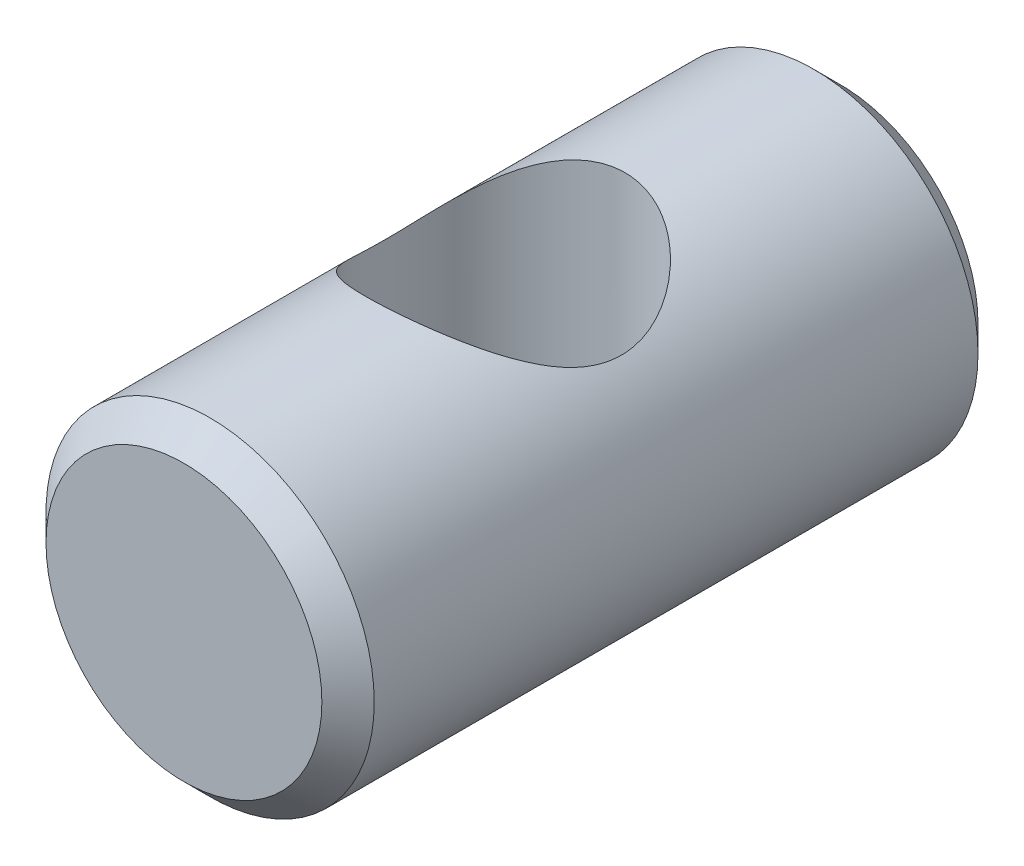
ISO-10303-21;
HEADER;
FILE_DESCRIPTION(('STEP AP214'),'2;1');
FILE_NAME('part.step','',(''),(''),'','','');
FILE_SCHEMA(('AUTOMOTIVE_DESIGN { 1 0 10303 214 1 1 1 1 }'));
ENDSEC;
DATA;
#1=APPLICATION_CONTEXT('core data for automotive mechanical design processes');
#2=APPLICATION_PROTOCOL_DEFINITION('international standard','automotive_design',2000,#1);
#3=PRODUCT_CONTEXT('',#1,'mechanical');
#4=PRODUCT('Part','Part','',(#3));
#5=PRODUCT_RELATED_PRODUCT_CATEGORY('part','',(#4));
#6=PRODUCT_DEFINITION_FORMATION('','',#4);
#7=PRODUCT_DEFINITION_CONTEXT('part definition',#1,'design');
#8=PRODUCT_DEFINITION('design','',#6,#7);
#9=PRODUCT_DEFINITION_SHAPE('','',#8);
#10=(LENGTH_UNIT() NAMED_UNIT(*) SI_UNIT(.MILLI.,.METRE.));
#11=(NAMED_UNIT(*) PLANE_ANGLE_UNIT() SI_UNIT($,.RADIAN.));
#12=(NAMED_UNIT(*) SI_UNIT($,.STERADIAN.) SOLID_ANGLE_UNIT());
#13=UNCERTAINTY_MEASURE_WITH_UNIT(LENGTH_MEASURE(1.E-05),#10,'distance_accuracy_value','');
#14=(GEOMETRIC_REPRESENTATION_CONTEXT(3) GLOBAL_UNCERTAINTY_ASSIGNED_CONTEXT((#13)) GLOBAL_UNIT_ASSIGNED_CONTEXT((#10,
#11,#12)) REPRESENTATION_CONTEXT('',''));
#15=CARTESIAN_POINT('',(0.,0.,0.));
#16=DIRECTION('',(0.,0.,1.));
#17=DIRECTION('',(1.,0.,0.));
#18=AXIS2_PLACEMENT_3D('',#15,#16,#17);
#19=CARTESIAN_POINT('',(0.,0.,9.525));
#20=DIRECTION('',(0.,0.,-1.));
#21=DIRECTION('',(-1.,0.,0.));
#22=AXIS2_PLACEMENT_3D('',#19,#20,#21);
#23=CYLINDRICAL_SURFACE('',#22,4.765);
#24=CARTESIAN_POINT('',(0.,-4.765,-3.42087708051605));
#25=CARTESIAN_POINT('',(-0.0833627581168181,-4.7649997101109,-3.42696899134863));
#26=CARTESIAN_POINT('',(-0.166953392424251,-4.76280757869707,-3.43001003086424));
#27=CARTESIAN_POINT('',(-0.333933182408652,-4.75402028790231,-3.4299899120654));
#28=CARTESIAN_POINT('',(-0.41732223719261,-4.74742325494959,-3.42692615604904));
#29=CARTESIAN_POINT('',(-0.583312250165056,-4.72989865727235,-3.41478160746824));
#30=CARTESIAN_POINT('',(-0.665912068503747,-4.71896558414041,-3.40569315136156));
#31=CARTESIAN_POINT('',(-0.829610597514772,-4.69295834085159,-3.38168739143667));
#32=CARTESIAN_POINT('',(-0.91070865358331,-4.67788240819801,-3.36676760565251));
#33=CARTESIAN_POINT('',(-1.15000632689336,-4.62699847385246,-3.31382161536754));
#34=CARTESIAN_POINT('',(-1.30524951697123,-4.58542013528299,-3.26752778272676));
#35=CARTESIAN_POINT('',(-1.60411463212557,-4.48962808746058,-3.15544383432779));
#36=CARTESIAN_POINT('',(-1.74773682156028,-4.43541466574349,-3.08965416222603));
#37=CARTESIAN_POINT('',(-2.03259497643689,-4.31273538578719,-2.93522566350036));
#38=CARTESIAN_POINT('',(-2.17272279857911,-4.24347672491827,-2.84518090003159));
#39=CARTESIAN_POINT('',(-2.43631552731587,-4.09784606286129,-2.64803347355049));
#40=CARTESIAN_POINT('',(-2.55976291960052,-4.02146672501527,-2.54091313456509));
#41=CARTESIAN_POINT('',(-2.81327393100644,-3.84950291536883,-2.28757037498761));
#42=CARTESIAN_POINT('',(-2.93940806717613,-3.75321839663728,-2.13784494064544));
#43=CARTESIAN_POINT('',(-3.10885207016274,-3.61188607024724,-1.89774924473951));
#44=CARTESIAN_POINT('',(-3.16205944901992,-3.56527135977744,-1.81509327318893));
#45=CARTESIAN_POINT('',(-3.26165283895997,-3.47438917550769,-1.64456461914389));
#46=CARTESIAN_POINT('',(-3.30804141803447,-3.43012082209569,-1.55669391813204));
#47=CARTESIAN_POINT('',(-3.41144333221737,-3.32784018306176,-1.33801732923479));
#48=CARTESIAN_POINT('',(-3.46485738281701,-3.27176419567389,-1.20454764001565));
#49=CARTESIAN_POINT('',(-3.55539465585279,-3.1731532714438,-0.92756721927326));
#50=CARTESIAN_POINT('',(-3.59255605597934,-3.13058666617785,-0.784080947165173));
#51=CARTESIAN_POINT('',(-3.64343651296181,-3.07113542283653,-0.514646140223209));
#52=CARTESIAN_POINT('',(-3.66010628533956,-3.05107413064414,-0.389980532152303));
#53=CARTESIAN_POINT('',(-3.67954153570878,-3.02761567970702,-0.13805144197163));
#54=CARTESIAN_POINT('',(-3.68232117171679,-3.02420155283186,-0.0107907379518655));
#55=CARTESIAN_POINT('',(-3.67376621747767,-3.03458366659267,0.242449329866106));
#56=CARTESIAN_POINT('',(-3.66243797397314,-3.04837216824954,0.368429244158408));
#57=CARTESIAN_POINT('',(-3.62657095184853,-3.09094772918142,0.615927376424316));
#58=CARTESIAN_POINT('',(-3.60201250089043,-3.11975712134959,0.737438661719832));
#59=CARTESIAN_POINT('',(-3.52797021750045,-3.20358122773375,1.02486117239319));
#60=CARTESIAN_POINT('',(-3.47231020523667,-3.26453704351351,1.18741075414518));
#61=CARTESIAN_POINT('',(-3.34017866781708,-3.39961296516166,1.498121783823));
#62=CARTESIAN_POINT('',(-3.2636446149314,-3.47377238661047,1.64623815847782));
#63=CARTESIAN_POINT('',(-3.12200897105521,-3.60054284241464,1.87825971607124));
#64=CARTESIAN_POINT('',(-3.06234750531042,-3.65156363596669,1.9664324955114));
#65=CARTESIAN_POINT('',(-2.93536296354977,-3.75440484501345,2.13658829521524));
#66=CARTESIAN_POINT('',(-2.86803758566651,-3.80622549668558,2.21856944344932));
#67=CARTESIAN_POINT('',(-2.65493557738645,-3.96070606463684,2.4548169203279));
#68=CARTESIAN_POINT('',(-2.4978237985218,-4.06258137631192,2.59972905493882));
#69=CARTESIAN_POINT('',(-2.18575837138569,-4.23718725327564,2.83706621766583));
#70=CARTESIAN_POINT('',(-2.03548298499758,-4.31186637762032,2.93424360521689));
#71=CARTESIAN_POINT('',(-1.71702572980925,-4.44824656330391,3.10568912436018));
#72=CARTESIAN_POINT('',(-1.54887024912961,-4.50996636079323,3.17999040299218));
#73=CARTESIAN_POINT('',(-1.22389848309853,-4.60778480850806,3.29263516387729));
#74=CARTESIAN_POINT('',(-1.06910753325384,-4.64632732736096,3.33468022800881));
#75=CARTESIAN_POINT('',(-0.752190984217971,-4.70801774696666,3.39687013419293));
#76=CARTESIAN_POINT('',(-0.590069112764688,-4.73117337991453,3.4170259792185));
#77=CARTESIAN_POINT('',(-0.262598143568304,-4.7606051003247,3.43390286080124));
#78=CARTESIAN_POINT('',(-0.0972412962651654,-4.76683385814853,3.43055828056669));
#79=CARTESIAN_POINT('',(0.231024129353291,-4.76222706928004,3.40010195996678));
#80=CARTESIAN_POINT('',(0.393932420256084,-4.75138953488968,3.37298745129903));
#81=CARTESIAN_POINT('',(0.705514268669747,-4.71498049061455,3.2979508357131));
#82=CARTESIAN_POINT('',(0.854498752183593,-4.69006694126301,3.25098003249397));
#83=CARTESIAN_POINT('',(1.14256413370517,-4.62833634686259,3.13840780618742));
#84=CARTESIAN_POINT('',(1.28164310390504,-4.59151699239254,3.07280276883643));
#85=CARTESIAN_POINT('',(1.5605913242394,-4.50478911028579,2.91796402171938));
#86=CARTESIAN_POINT('',(1.6992420339739,-4.45396042558585,2.82706121692328));
#87=CARTESIAN_POINT('',(1.96045324775841,-4.34533105232054,2.62789389216064));
#88=CARTESIAN_POINT('',(2.08299871660834,-4.28752394420402,2.51961335554432));
#89=CARTESIAN_POINT('',(2.33061071233595,-4.15886196775128,2.26753986981794));
#90=CARTESIAN_POINT('',(2.45245602746959,-4.08747815085455,2.12084350362776));
#91=CARTESIAN_POINT('',(2.67091966387116,-3.94818744226299,1.80818256348861));
#92=CARTESIAN_POINT('',(2.76753692468301,-3.88028069682256,1.64221717999394));
#93=CARTESIAN_POINT('',(2.91829752704228,-3.76775877390235,1.32363316444147));
#94=CARTESIAN_POINT('',(2.97693831230802,-3.72114907301219,1.17388770573105));
#95=CARTESIAN_POINT('',(3.04915600293589,-3.66180847873486,0.941826581338293));
#96=CARTESIAN_POINT('',(3.0706008978109,-3.64379412637323,0.863255129060434));
#97=CARTESIAN_POINT('',(3.10797188341904,-3.61197174564401,0.703992654043788));
#98=CARTESIAN_POINT('',(3.12390068817333,-3.59816164910817,0.623302694735672));
#99=CARTESIAN_POINT('',(3.15010468685879,-3.57524455910332,0.459495462666018));
#100=CARTESIAN_POINT('',(3.16032158062367,-3.5661861203942,0.376361962516616));
#101=CARTESIAN_POINT('',(3.17464168800661,-3.55344451616001,0.209195138832912));
#102=CARTESIAN_POINT('',(3.17874788699032,-3.54975872585817,0.125162274904956));
#103=CARTESIAN_POINT('',(3.18076053743013,-3.54795587812489,-0.0430393452037649));
#104=CARTESIAN_POINT('',(3.17866722999484,-3.54983860412504,-0.127208095972433));
#105=CARTESIAN_POINT('',(3.16833758034576,-3.55905933774995,-0.294840628996076));
#106=CARTESIAN_POINT('',(3.16010150131517,-3.56639711165655,-0.378304441298765));
#107=CARTESIAN_POINT('',(3.129430196119,-3.59341005189328,-0.604314657609784));
#108=CARTESIAN_POINT('',(3.10101793603989,-3.61818171011667,-0.745494317394035));
#109=CARTESIAN_POINT('',(3.02771937958645,-3.67972750014127,-1.02069983126741));
#110=CARTESIAN_POINT('',(2.98281650470617,-3.71651370639189,-1.1547183301723));
#111=CARTESIAN_POINT('',(2.8560768918245,-3.8153502491925,-1.46853642894096));
#112=CARTESIAN_POINT('',(2.76664814536404,-3.88152734494911,-1.64398166227299));
#113=CARTESIAN_POINT('',(2.56077346334119,-4.02033820070584,-1.97551522842484));
#114=CARTESIAN_POINT('',(2.44428083509274,-4.09298298410994,-2.13156938380249));
#115=CARTESIAN_POINT('',(2.18450650401399,-4.2373970566927,-2.42421216807333));
#116=CARTESIAN_POINT('',(2.04090097393914,-4.30914323590253,-2.56052605726515));
#117=CARTESIAN_POINT('',(1.72973058522059,-4.44318432752426,-2.80802181758102));
#118=CARTESIAN_POINT('',(1.56219804304704,-4.50549175797245,-2.91923707314102));
#119=CARTESIAN_POINT('',(1.23969583506405,-4.60338031575656,-3.09396462152008));
#120=CARTESIAN_POINT('',(1.08834922542924,-4.64178783933997,-3.16252149709775));
#121=CARTESIAN_POINT('',(0.85338781071092,-4.68864069192958,-3.24875451241662));
#122=CARTESIAN_POINT('',(0.773800863355168,-4.70245945854321,-3.27471971164357));
#123=CARTESIAN_POINT('',(0.612411306870997,-4.72618391319332,-3.32087000112459));
#124=CARTESIAN_POINT('',(0.530609679466058,-4.73609130567107,-3.34105760799584));
#125=CARTESIAN_POINT('',(0.374335243630177,-4.75084997254152,-3.37353939001354));
#126=CARTESIAN_POINT('',(0.300030947704158,-4.75613339853629,-3.38645258471521));
#127=CARTESIAN_POINT('',(0.150546671086999,-4.76320900575073,-3.40736829831093));
#128=CARTESIAN_POINT('',(0.0753664637160969,-4.76500026208246,-3.41536951590209));
#129=CARTESIAN_POINT('',(0.,-4.765,-3.42087708051605));
#130=B_SPLINE_CURVE_WITH_KNOTS('',3,(#24,#25,#26,#27,#28,#29,#30,#31,#32,#33,#34,#35,#36,#37,
#38,#39,#40,#41,#42,#43,#44,#45,#46,#47,#48,#49,#50,#51,#52,#53,#54,#55,#56,#57,#58,#59,#60,#61,
#62,#63,#64,#65,#66,#67,#68,#69,#70,#71,#72,#73,#74,#75,#76,#77,#78,#79,#80,#81,#82,#83,#84,#85,
#86,#87,#88,#89,#90,#91,#92,#93,#94,#95,#96,#97,#98,#99,#100,#101,#102,#103,#104,#105,#106,#107,
#108,#109,#110,#111,#112,#113,#114,#115,#116,#117,#118,#119,#120,#121,#122,#123,#124,#125,#126,
#127,#128,#129),.UNSPECIFIED.,.T.,.F.,(4,2,2,2,2,2,2,2,2,2,2,2,2,2,2,2,2,2,2,2,2,2,2,2,2,2,2,2,
2,2,2,2,2,2,2,2,2,2,2,2,2,2,2,2,2,2,2,2,2,2,2,2,4),(0.,0.250678148817341,0.501462988541287,
0.752567445437252,1.00377889552888,1.50309474088369,2.00239922444642,2.54160992918404,
3.08138247258981,3.73300244855075,4.05909733145616,4.38506908912952,4.84654436743379,
5.30692973453839,5.68734604359481,6.06737452056514,6.44723209503533,6.82765605484285,
7.37157480546313,7.91714109472133,8.27090631470675,8.62477807035776,9.33119791439566,
9.91077027397039,10.4894988486046,10.9822712500665,11.4747958366297,11.9686961727678,
12.4626540373564,12.9352342359093,13.4079061579591,13.9261848288361,14.4449439577642,
15.0533142145202,15.6617100398796,16.1619385675779,16.4119146790501,16.6617676221917,
16.9141262556176,17.1663615593023,17.4185870532858,17.6708017414467,18.1072101440206,
18.5440584873629,19.1640002904501,19.7850197135797,20.4139885307568,21.0421157411608,
21.5513660687497,21.8056438515067,22.059810706191,22.2863833912941,22.5130160751694),.UNSPECIFIED.);
#131=CARTESIAN_POINT('',(0.,-4.765,-3.42087708051605));
#132=VERTEX_POINT('',#131);
#133=EDGE_CURVE('E10',#132,#132,#130,.T.);
#134=ORIENTED_EDGE('',*,*,#133,.T.);
#135=EDGE_LOOP('',(#134));
#136=FACE_BOUND('',#135,.T.);
#137=CARTESIAN_POINT('',(-0.25,4.75843724346555,3.43));
#138=CARTESIAN_POINT('',(-0.422180009069406,4.749390618167,3.42999980483541));
#139=CARTESIAN_POINT('',(-0.59386282730199,4.73091871113112,3.41695856293195));
#140=CARTESIAN_POINT('',(-0.930629104770302,4.67635636796384,3.36610979440147));
#141=CARTESIAN_POINT('',(-1.09570851357914,4.64025529237457,3.32828730721862));
#142=CARTESIAN_POINT('',(-1.41392411864396,4.55336447971862,3.23075051942857));
#143=CARTESIAN_POINT('',(-1.56712334101048,4.5026601113221,3.17116292636266));
#144=CARTESIAN_POINT('',(-1.85998836726663,4.38979766700268,3.03299834240104));
#145=CARTESIAN_POINT('',(-1.99965414606241,4.32763956984278,2.95442131629586));
#146=CARTESIAN_POINT('',(-2.27820698899914,4.18828982189439,2.77162910883962));
#147=CARTESIAN_POINT('',(-2.41542819149111,4.11020218068904,2.66557505303866));
#148=CARTESIAN_POINT('',(-2.67111072919315,3.94883137284482,2.43572487373919));
#149=CARTESIAN_POINT('',(-2.78953546002451,3.86553849846079,2.31189500490524));
#150=CARTESIAN_POINT('',(-2.96344629098398,3.732292646302,2.10063521621267));
#151=CARTESIAN_POINT('',(-3.02522112465854,3.68226630299909,2.01833701427756));
#152=CARTESIAN_POINT('',(-3.14150590868554,3.58357003530251,1.84790207991889));
#153=CARTESIAN_POINT('',(-3.1960131207988,3.5349006275963,1.7597631654945));
#154=CARTESIAN_POINT('',(-3.29731229261899,3.44060115304685,1.57784833521895));
#155=CARTESIAN_POINT('',(-3.34411822611588,3.39496567295495,1.48408305992192));
#156=CARTESIAN_POINT('',(-3.42959137880208,3.30859742398812,1.29083456033672));
#157=CARTESIAN_POINT('',(-3.46826509160405,3.2678607546062,1.19135597958454));
#158=CARTESIAN_POINT('',(-3.54347659526858,3.18632211811376,0.966712328692861));
#159=CARTESIAN_POINT('',(-3.57812346664731,3.14705996480953,0.840323998552468));
#160=CARTESIAN_POINT('',(-3.63302442402354,3.08352956814293,0.580976208361932));
#161=CARTESIAN_POINT('',(-3.65331272726122,3.05922569654856,0.448033183521057));
#162=CARTESIAN_POINT('',(-3.67812283683354,3.02936636632518,0.177337549423231));
#163=CARTESIAN_POINT('',(-3.68251233934075,3.02396824643502,0.0395541719109347));
#164=CARTESIAN_POINT('',(-3.67470644643728,3.03344305810687,-0.234875874606968));
#165=CARTESIAN_POINT('',(-3.66249943392474,3.04833018879986,-0.37152167996018));
#166=CARTESIAN_POINT('',(-3.62015799382368,3.09852315491188,-0.655828380639309));
#167=CARTESIAN_POINT('',(-3.58799174144691,3.13612809889826,-0.802759414360211));
#168=CARTESIAN_POINT('',(-3.50660899556505,3.22685391573891,-1.08690765852793));
#169=CARTESIAN_POINT('',(-3.45734815065714,3.28001509196861,-1.22409847190397));
#170=CARTESIAN_POINT('',(-3.35999029035731,3.37921222953507,-1.45031682658415));
#171=CARTESIAN_POINT('',(-3.31552748835515,3.42299124550292,-1.54196683547208));
#172=CARTESIAN_POINT('',(-3.21937168211258,3.51357799533849,-1.7198719105116));
#173=CARTESIAN_POINT('',(-3.16767569861283,3.56038697291961,-1.80612473233373));
#174=CARTESIAN_POINT('',(-3.05733519065029,3.655577234441,-1.97327341136436));
#175=CARTESIAN_POINT('',(-2.99868376029761,3.70396004583247,-2.05416381804875));
#176=CARTESIAN_POINT('',(-2.87465956601933,3.80102084509467,-2.21043246978884));
#177=CARTESIAN_POINT('',(-2.80928649472037,3.84969884636825,-2.28581046249783));
#178=CARTESIAN_POINT('',(-2.6702557671566,3.94744940552613,-2.43263894546763));
#179=CARTESIAN_POINT('',(-2.59643405525365,3.99650228404323,-2.50394748039488));
#180=CARTESIAN_POINT('',(-2.44198609531555,4.09270177982323,-2.64020867362414));
#181=CARTESIAN_POINT('',(-2.36135999487914,4.13984843840247,-2.70516146972696));
#182=CARTESIAN_POINT('',(-2.19361254846785,4.2311207520192,-2.82808330517596));
#183=CARTESIAN_POINT('',(-2.10650409604225,4.27525208591359,-2.88606563800173));
#184=CARTESIAN_POINT('',(-1.92594548966524,4.3595756679867,-2.99452956360935));
#185=CARTESIAN_POINT('',(-1.8324951446076,4.39976779737236,-3.04501093021117));
#186=CARTESIAN_POINT('',(-1.58991791011193,4.49465680101692,-3.16160717844564));
#187=CARTESIAN_POINT('',(-1.43688887677842,4.54617300319559,-3.22239703143537));
#188=CARTESIAN_POINT('',(-1.11985321098478,4.63445714602499,-3.3220213557935));
#189=CARTESIAN_POINT('',(-0.955854490731875,4.67123558567514,-3.36087146486794));
#190=CARTESIAN_POINT('',(-0.620041304864638,4.72756501903715,-3.41423360193657));
#191=CARTESIAN_POINT('',(-0.448189976813925,4.74702354164412,-3.42861536060857));
#192=CARTESIAN_POINT('',(-0.10319553205656,4.76701209164517,-3.43119218349009));
#193=CARTESIAN_POINT('',(0.069947271391446,4.76754656888776,-3.41939340455174));
#194=CARTESIAN_POINT('',(0.396800733953032,4.75102741592386,-3.37216085402572));
#195=CARTESIAN_POINT('',(0.550903795546911,4.73547935394817,-3.33884247322146));
#196=CARTESIAN_POINT('',(0.851262679297079,4.69080460019725,-3.25216372524372));
#197=CARTESIAN_POINT('',(0.997516834516369,4.66167503663273,-3.19879911978834));
#198=CARTESIAN_POINT('',(1.28614476637547,4.59066745677348,-3.07104032256261));
#199=CARTESIAN_POINT('',(1.42797966766526,4.5482360225696,-2.99574591149817));
#200=CARTESIAN_POINT('',(1.69771873358212,4.45459184021555,-2.82781924377908));
#201=CARTESIAN_POINT('',(1.82561916137349,4.40337674596602,-2.73518235437366));
#202=CARTESIAN_POINT('',(2.08559098582612,4.28706511495821,-2.51852707855975));
#203=CARTESIAN_POINT('',(2.2150420244168,4.22105957781513,-2.39185853378127));
#204=CARTESIAN_POINT('',(2.4525288591269,4.08765163666692,-2.119882962336));
#205=CARTESIAN_POINT('',(2.56051870491994,4.02024656957631,-1.97453701758847));
#206=CARTESIAN_POINT('',(2.71141297716131,3.91890470250436,-1.73364032653499));
#207=CARTESIAN_POINT('',(2.76225962831151,3.88310759046258,-1.64375989611527));
#208=CARTESIAN_POINT('',(2.85606768069206,3.81463871939836,-1.45876664530863));
#209=CARTESIAN_POINT('',(2.8990272649147,3.78196768138303,-1.36365262576039));
#210=CARTESIAN_POINT('',(2.97638382467227,3.7213945324715,-1.16888238761678));
#211=CARTESIAN_POINT('',(3.01080676435227,3.6934780438477,-1.06924106056856));
#212=CARTESIAN_POINT('',(3.07061216797024,3.64390866973889,-0.865836413850732));
#213=CARTESIAN_POINT('',(3.09600079900905,3.62225151334222,-0.762075960014793));
#214=CARTESIAN_POINT('',(3.14431905107756,3.58048576732931,-0.51427610984992));
#215=CARTESIAN_POINT('',(3.1632690781055,3.56357947310397,-0.36886387726438));
#216=CARTESIAN_POINT('',(3.18229415057448,3.54660528363273,-0.0759553160984843));
#217=CARTESIAN_POINT('',(3.18238833621043,3.54652031339164,0.0715387471135818));
#218=CARTESIAN_POINT('',(3.16376347579515,3.56313911837427,0.36412784346974));
#219=CARTESIAN_POINT('',(3.14506985693007,3.57982020262542,0.509225849632981));
#220=CARTESIAN_POINT('',(3.09006178812863,3.6274007096972,0.793694678976364));
#221=CARTESIAN_POINT('',(3.05372153995533,3.65832094581284,0.933056792070445));
#222=CARTESIAN_POINT('',(2.94995679839854,3.74283457822027,1.249627259653));
#223=CARTESIAN_POINT('',(2.87616913174531,3.80056128592335,1.42363336901504));
#224=CARTESIAN_POINT('',(2.70309172031867,3.9255469405295,1.75476054116614));
#225=CARTESIAN_POINT('',(2.60375916203549,3.99282180458683,1.91185262262683));
#226=CARTESIAN_POINT('',(2.37965965281677,4.13038218124549,2.21024978907531));
#227=CARTESIAN_POINT('',(2.25446848393284,4.20070005001654,2.35122119961121));
#228=CARTESIAN_POINT('',(1.98132226028618,4.33621841215064,2.61183089931648));
#229=CARTESIAN_POINT('',(1.83339056066265,4.40142405331531,2.73149080683867));
#230=CARTESIAN_POINT('',(1.53413492006617,4.51378899534322,2.93439863762912));
#231=CARTESIAN_POINT('',(1.38501302638156,4.56214832085995,3.02021473285691));
#232=CARTESIAN_POINT('',(1.07249564524745,4.64554146755817,3.16951406225263));
#233=CARTESIAN_POINT('',(0.909111289256103,4.68058556855773,3.23301452201411));
#234=CARTESIAN_POINT('',(0.581478494873657,4.73212589223905,3.33183530764178));
#235=CARTESIAN_POINT('',(0.417802064196769,4.74955942472212,3.36854686433097));
#236=CARTESIAN_POINT('',(0.0859254534274418,4.76711849433294,3.41762518536938));
#237=CARTESIAN_POINT('',(-0.0822731758795955,4.76724989098796,3.43000019011695));
#238=CARTESIAN_POINT('',(-0.25,4.75843724346555,3.43));
#239=B_SPLINE_CURVE_WITH_KNOTS('',3,(#137,#138,#139,#140,#141,#142,#143,#144,#145,#146,#147,
#148,#149,#150,#151,#152,#153,#154,#155,#156,#157,#158,#159,#160,#161,#162,#163,#164,#165,#166,
#167,#168,#169,#170,#171,#172,#173,#174,#175,#176,#177,#178,#179,#180,#181,#182,#183,#184,#185,
#186,#187,#188,#189,#190,#191,#192,#193,#194,#195,#196,#197,#198,#199,#200,#201,#202,#203,#204,
#205,#206,#207,#208,#209,#210,#211,#212,#213,#214,#215,#216,#217,#218,#219,#220,#221,#222,#223,
#224,#225,#226,#227,#228,#229,#230,#231,#232,#233,#234,#235,#236,#237,#238),.UNSPECIFIED.,.T.,
.F.,(4,2,2,2,2,2,2,2,2,2,2,2,2,2,2,2,2,2,2,2,2,2,2,2,2,2,2,2,2,2,2,2,2,2,2,2,2,2,2,2,2,2,2,2,2,
2,2,2,2,2,4),(0.,0.516551025096824,1.03341418220019,1.54731512007828,2.06121701081903,
2.62982932183038,3.19953571462131,3.54246459279583,3.88552231417978,4.22795053195655,
4.57010427222594,4.97905439316964,5.38702665221778,5.79838620186915,6.21003384012951,
6.67262967068467,7.1364347778277,7.46866532411958,7.80103311718076,8.13373371721725,
8.46644953806418,8.80733809568013,9.14821926074384,9.48843965067855,9.82867029735156,
10.3440014803113,10.8589648922706,11.3766614843259,11.8942363430695,12.3673901670618,
12.8406440841658,13.3370245096255,13.8335377244494,14.4096746680997,14.9870321881218,
15.3145391492316,15.6421214663625,15.968694875667,16.2950449261748,16.7357599059526,
17.1760275223247,17.6157000871626,18.0560173690192,18.6457302885718,19.2364380888803,
19.8377403374759,20.4384291081866,20.9723943239786,21.5059464582794,22.0093081125728,
22.5124992983782),.UNSPECIFIED.);
#240=CARTESIAN_POINT('',(-0.25,4.75843724346555,3.43));
#241=VERTEX_POINT('',#240);
#242=EDGE_CURVE('E59',#241,#241,#239,.T.);
#243=ORIENTED_EDGE('',*,*,#242,.T.);
#244=EDGE_LOOP('',(#243));
#245=FACE_BOUND('',#244,.T.);
#246=CARTESIAN_POINT('',(0.,0.,-8.76499999999999));
#247=DIRECTION('',(0.,0.,1.));
#248=DIRECTION('',(1.,0.,0.));
#249=AXIS2_PLACEMENT_3D('',#246,#247,#248);
#250=CIRCLE('',#249,4.765);
#251=CARTESIAN_POINT('',(4.765,0.,-8.76499999999999));
#252=VERTEX_POINT('',#251);
#253=EDGE_CURVE('E103',#252,#252,#250,.T.);
#254=ORIENTED_EDGE('',*,*,#253,.T.);
#255=EDGE_LOOP('',(#254));
#256=FACE_BOUND('',#255,.T.);
#257=CARTESIAN_POINT('',(0.,0.,8.76500000000001));
#258=DIRECTION('',(0.,0.,1.));
#259=DIRECTION('',(1.,0.,0.));
#260=AXIS2_PLACEMENT_3D('',#257,#258,#259);
#261=CIRCLE('',#260,4.765);
#262=CARTESIAN_POINT('',(4.765,0.,8.76500000000001));
#263=VERTEX_POINT('',#262);
#264=EDGE_CURVE('E106',#263,#263,#261,.F.);
#265=ORIENTED_EDGE('',*,*,#264,.T.);
#266=EDGE_LOOP('',(#265));
#267=FACE_BOUND('',#266,.T.);
#268=ADVANCED_FACE('F45',(#136,#245,#256,#267),#23,.T.);
#269=CARTESIAN_POINT('',(0.,0.,9.525));
#270=DIRECTION('',(0.,0.,1.));
#271=DIRECTION('',(1.,0.,0.));
#272=AXIS2_PLACEMENT_3D('',#269,#270,#271);
#273=PLANE('',#272);
#274=CARTESIAN_POINT('',(0.,0.,9.525));
#275=DIRECTION('',(0.,0.,1.));
#276=DIRECTION('',(1.,0.,0.));
#277=AXIS2_PLACEMENT_3D('',#274,#275,#276);
#278=CIRCLE('',#277,4.00500000000001);
#279=CARTESIAN_POINT('',(4.00500000000001,0.,9.525));
#280=VERTEX_POINT('',#279);
#281=EDGE_CURVE('E64',#280,#280,#278,.T.);
#282=ORIENTED_EDGE('',*,*,#281,.T.);
#283=EDGE_LOOP('',(#282));
#284=FACE_BOUND('',#283,.T.);
#285=ADVANCED_FACE('F82',(#284),#273,.T.);
#286=CARTESIAN_POINT('',(0.,0.,-9.525));
#287=DIRECTION('',(0.,0.,1.));
#288=DIRECTION('',(1.,0.,0.));
#289=AXIS2_PLACEMENT_3D('',#286,#287,#288);
#290=PLANE('',#289);
#291=CARTESIAN_POINT('',(0.,0.,-9.525));
#292=DIRECTION('',(0.,0.,1.));
#293=DIRECTION('',(1.,0.,0.));
#294=AXIS2_PLACEMENT_3D('',#291,#292,#293);
#295=CIRCLE('',#294,4.00499999999998);
#296=CARTESIAN_POINT('',(4.00499999999998,0.,-9.525));
#297=VERTEX_POINT('',#296);
#298=EDGE_CURVE('E69',#297,#297,#295,.F.);
#299=ORIENTED_EDGE('',*,*,#298,.T.);
#300=EDGE_LOOP('',(#299));
#301=FACE_BOUND('',#300,.T.);
#302=ADVANCED_FACE('F85',(#301),#290,.F.);
#303=CARTESIAN_POINT('',(0.,0.,-8.76499999999999));
#304=DIRECTION('',(0.,0.,1.));
#305=DIRECTION('',(1.,0.,0.));
#306=AXIS2_PLACEMENT_3D('',#303,#304,#305);
#307=CONICAL_SURFACE('',#306,4.765,0.785398163397451);
#308=ORIENTED_EDGE('',*,*,#298,.F.);
#309=EDGE_LOOP('',(#308));
#310=FACE_BOUND('',#309,.T.);
#311=ORIENTED_EDGE('',*,*,#253,.F.);
#312=EDGE_LOOP('',(#311));
#313=FACE_BOUND('',#312,.T.);
#314=ADVANCED_FACE('F88',(#310,#313),#307,.T.);
#315=CARTESIAN_POINT('',(0.,0.,9.525));
#316=DIRECTION('',(0.,0.,-1.));
#317=DIRECTION('',(-1.,0.,0.));
#318=AXIS2_PLACEMENT_3D('',#315,#316,#317);
#319=CONICAL_SURFACE('',#318,4.00500000000001,0.785398163397448);
#320=ORIENTED_EDGE('',*,*,#264,.F.);
#321=EDGE_LOOP('',(#320));
#322=FACE_BOUND('',#321,.T.);
#323=ORIENTED_EDGE('',*,*,#281,.F.);
#324=EDGE_LOOP('',(#323));
#325=FACE_BOUND('',#324,.T.);
#326=ADVANCED_FACE('F48',(#322,#325),#319,.T.);
#327=CARTESIAN_POINT('',(-0.25,-4.765,0.));
#328=DIRECTION('',(0.,1.,0.));
#329=DIRECTION('',(0.,0.,1.));
#330=AXIS2_PLACEMENT_3D('',#327,#328,#329);
#331=CYLINDRICAL_SURFACE('',#330,3.43);
#332=ORIENTED_EDGE('',*,*,#242,.F.);
#333=EDGE_LOOP('',(#332));
#334=FACE_BOUND('',#333,.T.);
#335=ORIENTED_EDGE('',*,*,#133,.F.);
#336=EDGE_LOOP('',(#335));
#337=FACE_BOUND('',#336,.T.);
#338=ADVANCED_FACE('F77',(#334,#337),#331,.F.);
#339=CLOSED_SHELL('',(#268,#285,#302,#314,#326,#338));
#340=MANIFOLD_SOLID_BREP('B2',#339);
#341=ADVANCED_BREP_SHAPE_REPRESENTATION('',(#18,#340),#14);
#342=SHAPE_DEFINITION_REPRESENTATION(#9,#341);
ENDSEC;
END-ISO-10303-21;
